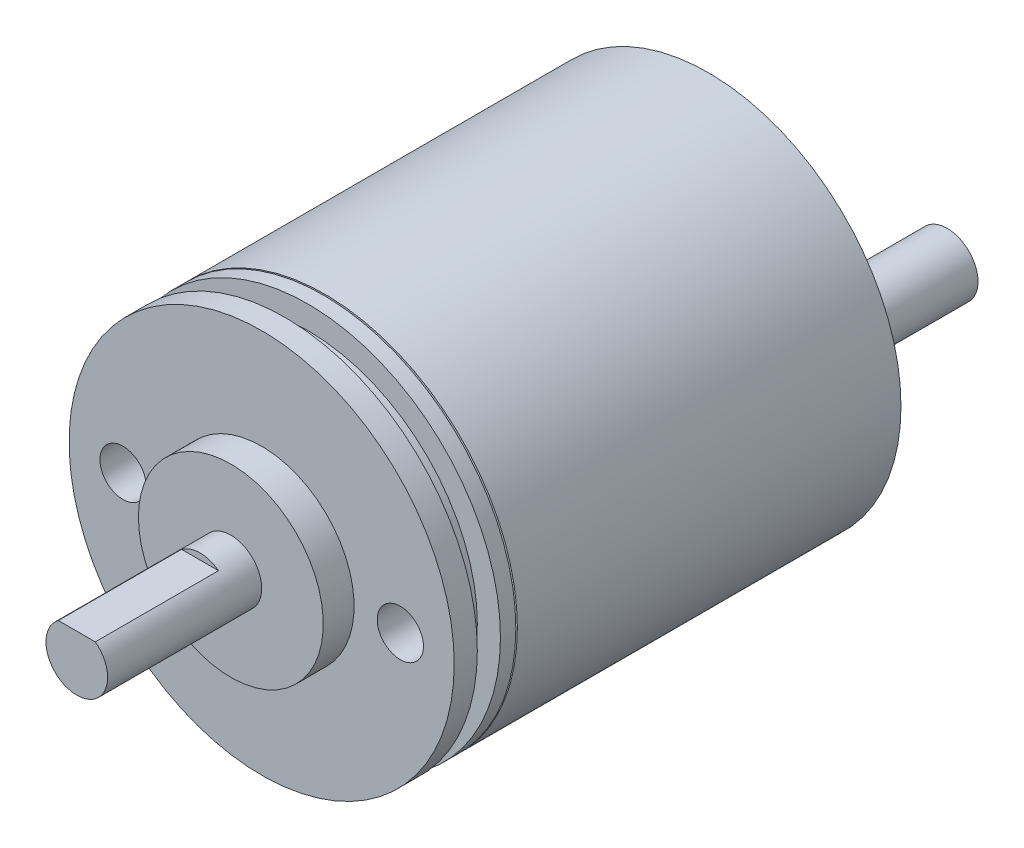
ISO-10303-21;
HEADER;
FILE_DESCRIPTION(('STEP AP214'),'2;1');
FILE_NAME('part.step','',(''),(''),'','','');
FILE_SCHEMA(('AUTOMOTIVE_DESIGN { 1 0 10303 214 1 1 1 1 }'));
ENDSEC;
DATA;
#1=APPLICATION_CONTEXT('core data for automotive mechanical design processes');
#2=APPLICATION_PROTOCOL_DEFINITION('international standard','automotive_design',2000,#1);
#3=PRODUCT_CONTEXT('',#1,'mechanical');
#4=PRODUCT('Part','Part','',(#3));
#5=PRODUCT_RELATED_PRODUCT_CATEGORY('part','',(#4));
#6=PRODUCT_DEFINITION_FORMATION('','',#4);
#7=PRODUCT_DEFINITION_CONTEXT('part definition',#1,'design');
#8=PRODUCT_DEFINITION('design','',#6,#7);
#9=PRODUCT_DEFINITION_SHAPE('','',#8);
#10=(LENGTH_UNIT() NAMED_UNIT(*) SI_UNIT(.MILLI.,.METRE.));
#11=(NAMED_UNIT(*) PLANE_ANGLE_UNIT() SI_UNIT($,.RADIAN.));
#12=(NAMED_UNIT(*) SI_UNIT($,.STERADIAN.) SOLID_ANGLE_UNIT());
#13=UNCERTAINTY_MEASURE_WITH_UNIT(LENGTH_MEASURE(1.E-05),#10,'distance_accuracy_value','');
#14=(GEOMETRIC_REPRESENTATION_CONTEXT(3) GLOBAL_UNCERTAINTY_ASSIGNED_CONTEXT((#13)) GLOBAL_UNIT_ASSIGNED_CONTEXT((#10,
#11,#12)) REPRESENTATION_CONTEXT('',''));
#15=CARTESIAN_POINT('',(0.,0.,0.));
#16=DIRECTION('',(0.,0.,1.));
#17=DIRECTION('',(1.,0.,0.));
#18=AXIS2_PLACEMENT_3D('',#15,#16,#17);
#19=CARTESIAN_POINT('',(-9.,0.,4.));
#20=DIRECTION('',(0.,0.,1.));
#21=DIRECTION('',(1.,0.,0.));
#22=AXIS2_PLACEMENT_3D('',#19,#20,#21);
#23=PLANE('',#22);
#24=CARTESIAN_POINT('',(-9.,0.,4.));
#25=DIRECTION('',(0.,0.,-1.));
#26=DIRECTION('',(-1.,0.,0.));
#27=AXIS2_PLACEMENT_3D('',#24,#25,#26);
#28=CIRCLE('',#27,2.);
#29=CARTESIAN_POINT('',(-10.2,1.6,4.));
#30=VERTEX_POINT('',#29);
#31=CARTESIAN_POINT('',(-7.8,1.6,4.));
#32=VERTEX_POINT('',#31);
#33=EDGE_CURVE('E19',#30,#32,#28,.T.);
#34=ORIENTED_EDGE('',*,*,#33,.F.);
#35=DIRECTION('',(1.,0.,0.));
#36=VECTOR('',#35,1.);
#37=CARTESIAN_POINT('',(-10.2,1.6,4.));
#38=LINE('',#37,#36);
#39=EDGE_CURVE('E33',#30,#32,#38,.T.);
#40=ORIENTED_EDGE('',*,*,#39,.T.);
#41=EDGE_LOOP('',(#34,#40));
#42=FACE_BOUND('',#41,.T.);
#43=ADVANCED_FACE('F16',(#42),#23,.T.);
#44=CARTESIAN_POINT('',(-10.2,1.6,4.));
#45=DIRECTION('',(0.,-1.,0.));
#46=DIRECTION('',(0.,0.,-1.));
#47=AXIS2_PLACEMENT_3D('',#44,#45,#46);
#48=PLANE('',#47);
#49=DIRECTION('',(0.,0.,-1.));
#50=VECTOR('',#49,1.);
#51=CARTESIAN_POINT('',(-7.8,1.6,-16.4289118373157));
#52=LINE('',#51,#50);
#53=CARTESIAN_POINT('',(-7.8,1.6,12.));
#54=VERTEX_POINT('',#53);
#55=EDGE_CURVE('E50',#32,#54,#52,.F.);
#56=ORIENTED_EDGE('',*,*,#55,.F.);
#57=ORIENTED_EDGE('',*,*,#39,.F.);
#58=DIRECTION('',(0.,0.,-1.));
#59=VECTOR('',#58,1.);
#60=CARTESIAN_POINT('',(-10.2,1.6,-16.4289118373157));
#61=LINE('',#60,#59);
#62=CARTESIAN_POINT('',(-10.2,1.6,12.));
#63=VERTEX_POINT('',#62);
#64=EDGE_CURVE('E54',#63,#30,#61,.T.);
#65=ORIENTED_EDGE('',*,*,#64,.F.);
#66=DIRECTION('',(1.,0.,0.));
#67=VECTOR('',#66,1.);
#68=CARTESIAN_POINT('',(-11.,1.6,12.));
#69=LINE('',#68,#67);
#70=EDGE_CURVE('E47',#54,#63,#69,.F.);
#71=ORIENTED_EDGE('',*,*,#70,.F.);
#72=EDGE_LOOP('',(#56,#57,#65,#71));
#73=FACE_BOUND('',#72,.T.);
#74=ADVANCED_FACE('F52',(#73),#48,.F.);
#75=CARTESIAN_POINT('',(-11.,0.,12.));
#76=DIRECTION('',(0.,0.,1.));
#77=DIRECTION('',(1.,0.,0.));
#78=AXIS2_PLACEMENT_3D('',#75,#76,#77);
#79=PLANE('',#78);
#80=CARTESIAN_POINT('',(-9.,0.,12.));
#81=DIRECTION('',(0.,0.,-1.));
#82=DIRECTION('',(-1.,0.,0.));
#83=AXIS2_PLACEMENT_3D('',#80,#81,#82);
#84=CIRCLE('',#83,2.);
#85=EDGE_CURVE('E42',#54,#63,#84,.T.);
#86=ORIENTED_EDGE('',*,*,#85,.F.);
#87=ORIENTED_EDGE('',*,*,#70,.T.);
#88=EDGE_LOOP('',(#86,#87));
#89=FACE_BOUND('',#88,.T.);
#90=ADVANCED_FACE('F46',(#89),#79,.T.);
#91=CARTESIAN_POINT('',(-9.,0.,-16.4289118373157));
#92=DIRECTION('',(0.,0.,-1.));
#93=DIRECTION('',(-1.,0.,0.));
#94=AXIS2_PLACEMENT_3D('',#91,#92,#93);
#95=CYLINDRICAL_SURFACE('',#94,2.);
#96=ORIENTED_EDGE('',*,*,#55,.T.);
#97=ORIENTED_EDGE('',*,*,#85,.T.);
#98=ORIENTED_EDGE('',*,*,#64,.T.);
#99=ORIENTED_EDGE('',*,*,#33,.T.);
#100=EDGE_LOOP('',(#96,#97,#98,#99));
#101=FACE_BOUND('',#100,.T.);
#102=CARTESIAN_POINT('',(-9.,0.,2.));
#103=DIRECTION('',(0.,0.,-1.));
#104=DIRECTION('',(-1.,0.,0.));
#105=AXIS2_PLACEMENT_3D('',#102,#103,#104);
#106=CIRCLE('',#105,2.);
#107=CARTESIAN_POINT('',(-11.,0.,2.));
#108=VERTEX_POINT('',#107);
#109=EDGE_CURVE('E49',#108,#108,#106,.T.);
#110=ORIENTED_EDGE('',*,*,#109,.F.);
#111=EDGE_LOOP('',(#110));
#112=FACE_BOUND('',#111,.T.);
#113=ADVANCED_FACE('F56',(#101,#112),#95,.T.);
#114=CARTESIAN_POINT('',(-18.,0.,-4.));
#115=DIRECTION('',(0.,0.,1.));
#116=DIRECTION('',(1.,0.,0.));
#117=AXIS2_PLACEMENT_3D('',#114,#115,#116);
#118=PLANE('',#117);
#119=CARTESIAN_POINT('',(-18.,0.,-4.));
#120=DIRECTION('',(0.,0.,1.));
#121=DIRECTION('',(1.,0.,0.));
#122=AXIS2_PLACEMENT_3D('',#119,#120,#121);
#123=CIRCLE('',#122,1.5);
#124=CARTESIAN_POINT('',(-16.5,0.,-4.));
#125=VERTEX_POINT('',#124);
#126=EDGE_CURVE('E115',#125,#125,#123,.T.);
#127=ORIENTED_EDGE('',*,*,#126,.T.);
#128=EDGE_LOOP('',(#127));
#129=FACE_BOUND('',#128,.T.);
#130=ADVANCED_FACE('F123',(#129),#118,.T.);
#131=CARTESIAN_POINT('',(0.,0.,-4.));
#132=DIRECTION('',(0.,0.,1.));
#133=DIRECTION('',(1.,0.,0.));
#134=AXIS2_PLACEMENT_3D('',#131,#132,#133);
#135=PLANE('',#134);
#136=CARTESIAN_POINT('',(0.,0.,-4.));
#137=DIRECTION('',(0.,0.,1.));
#138=DIRECTION('',(1.,0.,0.));
#139=AXIS2_PLACEMENT_3D('',#136,#137,#138);
#140=CIRCLE('',#139,1.5);
#141=CARTESIAN_POINT('',(1.5,0.,-4.));
#142=VERTEX_POINT('',#141);
#143=EDGE_CURVE('E112',#142,#142,#140,.T.);
#144=ORIENTED_EDGE('',*,*,#143,.T.);
#145=EDGE_LOOP('',(#144));
#146=FACE_BOUND('',#145,.T.);
#147=ADVANCED_FACE('F130',(#146),#135,.T.);
#148=CARTESIAN_POINT('',(-15.,0.,2.));
#149=DIRECTION('',(0.,0.,1.));
#150=DIRECTION('',(1.,0.,0.));
#151=AXIS2_PLACEMENT_3D('',#148,#149,#150);
#152=PLANE('',#151);
#153=CARTESIAN_POINT('',(-9.,0.,2.));
#154=DIRECTION('',(0.,0.,-1.));
#155=DIRECTION('',(-1.,0.,0.));
#156=AXIS2_PLACEMENT_3D('',#153,#154,#155);
#157=CIRCLE('',#156,6.);
#158=CARTESIAN_POINT('',(-15.,0.,2.));
#159=VERTEX_POINT('',#158);
#160=EDGE_CURVE('E109',#159,#159,#157,.T.);
#161=ORIENTED_EDGE('',*,*,#160,.F.);
#162=EDGE_LOOP('',(#161));
#163=FACE_BOUND('',#162,.T.);
#164=ORIENTED_EDGE('',*,*,#109,.T.);
#165=EDGE_LOOP('',(#164));
#166=FACE_BOUND('',#165,.T.);
#167=ADVANCED_FACE('F121',(#163,#166),#152,.T.);
#168=CARTESIAN_POINT('',(-18.,0.,-4.));
#169=DIRECTION('',(0.,0.,1.));
#170=DIRECTION('',(1.,0.,0.));
#171=AXIS2_PLACEMENT_3D('',#168,#169,#170);
#172=CYLINDRICAL_SURFACE('',#171,1.5);
#173=CARTESIAN_POINT('',(-18.,0.,0.));
#174=DIRECTION('',(0.,0.,1.));
#175=DIRECTION('',(1.,0.,0.));
#176=AXIS2_PLACEMENT_3D('',#173,#174,#175);
#177=CIRCLE('',#176,1.5);
#178=CARTESIAN_POINT('',(-16.5,0.,0.));
#179=VERTEX_POINT('',#178);
#180=EDGE_CURVE('E106',#179,#179,#177,.F.);
#181=ORIENTED_EDGE('',*,*,#180,.F.);
#182=EDGE_LOOP('',(#181));
#183=FACE_BOUND('',#182,.T.);
#184=ORIENTED_EDGE('',*,*,#126,.F.);
#185=EDGE_LOOP('',(#184));
#186=FACE_BOUND('',#185,.T.);
#187=ADVANCED_FACE('F205',(#183,#186),#172,.F.);
#188=CARTESIAN_POINT('',(0.,0.,-4.));
#189=DIRECTION('',(0.,0.,1.));
#190=DIRECTION('',(1.,0.,0.));
#191=AXIS2_PLACEMENT_3D('',#188,#189,#190);
#192=CYLINDRICAL_SURFACE('',#191,1.5);
#193=CARTESIAN_POINT('',(0.,0.,0.));
#194=DIRECTION('',(0.,0.,1.));
#195=DIRECTION('',(1.,0.,0.));
#196=AXIS2_PLACEMENT_3D('',#193,#194,#195);
#197=CIRCLE('',#196,1.5);
#198=CARTESIAN_POINT('',(1.5,0.,0.));
#199=VERTEX_POINT('',#198);
#200=EDGE_CURVE('E103',#199,#199,#197,.F.);
#201=ORIENTED_EDGE('',*,*,#200,.F.);
#202=EDGE_LOOP('',(#201));
#203=FACE_BOUND('',#202,.T.);
#204=ORIENTED_EDGE('',*,*,#143,.F.);
#205=EDGE_LOOP('',(#204));
#206=FACE_BOUND('',#205,.T.);
#207=ADVANCED_FACE('F201',(#203,#206),#192,.F.);
#208=CARTESIAN_POINT('',(-9.,0.,-16.4289118373157));
#209=DIRECTION('',(0.,0.,-1.));
#210=DIRECTION('',(-1.,0.,0.));
#211=AXIS2_PLACEMENT_3D('',#208,#209,#210);
#212=CYLINDRICAL_SURFACE('',#211,6.);
#213=CARTESIAN_POINT('',(-9.,0.,0.));
#214=DIRECTION('',(0.,0.,-1.));
#215=DIRECTION('',(-1.,0.,0.));
#216=AXIS2_PLACEMENT_3D('',#213,#214,#215);
#217=CIRCLE('',#216,6.);
#218=CARTESIAN_POINT('',(-15.,0.,0.));
#219=VERTEX_POINT('',#218);
#220=EDGE_CURVE('E100',#219,#219,#217,.T.);
#221=ORIENTED_EDGE('',*,*,#220,.F.);
#222=EDGE_LOOP('',(#221));
#223=FACE_BOUND('',#222,.T.);
#224=ORIENTED_EDGE('',*,*,#160,.T.);
#225=EDGE_LOOP('',(#224));
#226=FACE_BOUND('',#225,.T.);
#227=ADVANCED_FACE('F197',(#223,#226),#212,.T.);
#228=CARTESIAN_POINT('',(-9.,0.,0.));
#229=DIRECTION('',(0.,0.,1.));
#230=DIRECTION('',(1.,0.,0.));
#231=AXIS2_PLACEMENT_3D('',#228,#229,#230);
#232=PLANE('',#231);
#233=CARTESIAN_POINT('',(-9.,0.,0.));
#234=DIRECTION('',(0.,0.,1.));
#235=DIRECTION('',(1.,0.,0.));
#236=AXIS2_PLACEMENT_3D('',#233,#234,#235);
#237=CIRCLE('',#236,12.5);
#238=CARTESIAN_POINT('',(3.5,0.,0.));
#239=VERTEX_POINT('',#238);
#240=EDGE_CURVE('E97',#239,#239,#237,.F.);
#241=ORIENTED_EDGE('',*,*,#240,.F.);
#242=EDGE_LOOP('',(#241));
#243=FACE_BOUND('',#242,.T.);
#244=ORIENTED_EDGE('',*,*,#220,.T.);
#245=EDGE_LOOP('',(#244));
#246=FACE_BOUND('',#245,.T.);
#247=ORIENTED_EDGE('',*,*,#200,.T.);
#248=EDGE_LOOP('',(#247));
#249=FACE_BOUND('',#248,.T.);
#250=ORIENTED_EDGE('',*,*,#180,.T.);
#251=EDGE_LOOP('',(#250));
#252=FACE_BOUND('',#251,.T.);
#253=ADVANCED_FACE('F193',(#243,#246,#249,#252),#232,.T.);
#254=CARTESIAN_POINT('',(-9.,0.,-29.));
#255=DIRECTION('',(0.,0.,1.));
#256=DIRECTION('',(1.,0.,0.));
#257=AXIS2_PLACEMENT_3D('',#254,#255,#256);
#258=CYLINDRICAL_SURFACE('',#257,12.5);
#259=ORIENTED_EDGE('',*,*,#240,.T.);
#260=EDGE_LOOP('',(#259));
#261=FACE_BOUND('',#260,.T.);
#262=CARTESIAN_POINT('',(-9.,0.,-1.5));
#263=DIRECTION('',(0.,0.,1.));
#264=DIRECTION('',(1.,0.,0.));
#265=AXIS2_PLACEMENT_3D('',#262,#263,#264);
#266=CIRCLE('',#265,12.5);
#267=CARTESIAN_POINT('',(3.5,0.,-1.5));
#268=VERTEX_POINT('',#267);
#269=EDGE_CURVE('E94',#268,#268,#266,.T.);
#270=ORIENTED_EDGE('',*,*,#269,.T.);
#271=EDGE_LOOP('',(#270));
#272=FACE_BOUND('',#271,.T.);
#273=ADVANCED_FACE('F189',(#261,#272),#258,.T.);
#274=CARTESIAN_POINT('',(-9.,0.,-1.5));
#275=DIRECTION('',(0.,0.,1.));
#276=DIRECTION('',(1.,0.,0.));
#277=AXIS2_PLACEMENT_3D('',#274,#275,#276);
#278=PLANE('',#277);
#279=ORIENTED_EDGE('',*,*,#269,.F.);
#280=EDGE_LOOP('',(#279));
#281=FACE_BOUND('',#280,.T.);
#282=CARTESIAN_POINT('',(-9.,0.,-1.5));
#283=DIRECTION('',(0.,0.,1.));
#284=DIRECTION('',(1.,0.,0.));
#285=AXIS2_PLACEMENT_3D('',#282,#283,#284);
#286=CIRCLE('',#285,11.);
#287=CARTESIAN_POINT('',(2.,0.,-1.5));
#288=VERTEX_POINT('',#287);
#289=EDGE_CURVE('E91',#288,#288,#286,.F.);
#290=ORIENTED_EDGE('',*,*,#289,.F.);
#291=EDGE_LOOP('',(#290));
#292=FACE_BOUND('',#291,.T.);
#293=ADVANCED_FACE('F185',(#281,#292),#278,.F.);
#294=CARTESIAN_POINT('',(-9.,0.,-3.));
#295=DIRECTION('',(0.,0.,1.));
#296=DIRECTION('',(1.,0.,0.));
#297=AXIS2_PLACEMENT_3D('',#294,#295,#296);
#298=CYLINDRICAL_SURFACE('',#297,11.);
#299=CARTESIAN_POINT('',(-9.,0.,-3.));
#300=DIRECTION('',(0.,0.,1.));
#301=DIRECTION('',(1.,0.,0.));
#302=AXIS2_PLACEMENT_3D('',#299,#300,#301);
#303=CIRCLE('',#302,11.);
#304=CARTESIAN_POINT('',(2.,0.,-3.));
#305=VERTEX_POINT('',#304);
#306=EDGE_CURVE('E88',#305,#305,#303,.F.);
#307=ORIENTED_EDGE('',*,*,#306,.F.);
#308=EDGE_LOOP('',(#307));
#309=FACE_BOUND('',#308,.T.);
#310=ORIENTED_EDGE('',*,*,#289,.T.);
#311=EDGE_LOOP('',(#310));
#312=FACE_BOUND('',#311,.T.);
#313=ADVANCED_FACE('F181',(#309,#312),#298,.T.);
#314=CARTESIAN_POINT('',(-9.,-6.,-44.5));
#315=DIRECTION('',(0.,0.,-1.));
#316=DIRECTION('',(-1.,0.,0.));
#317=AXIS2_PLACEMENT_3D('',#314,#315,#316);
#318=PLANE('',#317);
#319=CARTESIAN_POINT('',(-9.,-6.,-44.5));
#320=DIRECTION('',(0.,0.,1.));
#321=DIRECTION('',(1.,0.,0.));
#322=AXIS2_PLACEMENT_3D('',#319,#320,#321);
#323=CIRCLE('',#322,2.);
#324=CARTESIAN_POINT('',(-7.,-6.,-44.5));
#325=VERTEX_POINT('',#324);
#326=EDGE_CURVE('E85',#325,#325,#323,.T.);
#327=ORIENTED_EDGE('',*,*,#326,.F.);
#328=EDGE_LOOP('',(#327));
#329=FACE_BOUND('',#328,.T.);
#330=ADVANCED_FACE('F177',(#329),#318,.T.);
#331=CARTESIAN_POINT('',(-9.,0.,-3.));
#332=DIRECTION('',(0.,0.,1.));
#333=DIRECTION('',(1.,0.,0.));
#334=AXIS2_PLACEMENT_3D('',#331,#332,#333);
#335=PLANE('',#334);
#336=CARTESIAN_POINT('',(-9.,0.,-3.));
#337=DIRECTION('',(0.,0.,1.));
#338=DIRECTION('',(1.,0.,0.));
#339=AXIS2_PLACEMENT_3D('',#336,#337,#338);
#340=CIRCLE('',#339,12.5);
#341=CARTESIAN_POINT('',(3.5,0.,-3.));
#342=VERTEX_POINT('',#341);
#343=EDGE_CURVE('E82',#342,#342,#340,.F.);
#344=ORIENTED_EDGE('',*,*,#343,.F.);
#345=EDGE_LOOP('',(#344));
#346=FACE_BOUND('',#345,.T.);
#347=ORIENTED_EDGE('',*,*,#306,.T.);
#348=EDGE_LOOP('',(#347));
#349=FACE_BOUND('',#348,.T.);
#350=ADVANCED_FACE('F173',(#346,#349),#335,.T.);
#351=CARTESIAN_POINT('',(-9.,-6.,-44.5));
#352=DIRECTION('',(0.,0.,1.));
#353=DIRECTION('',(1.,0.,0.));
#354=AXIS2_PLACEMENT_3D('',#351,#352,#353);
#355=CYLINDRICAL_SURFACE('',#354,2.);
#356=CARTESIAN_POINT('',(-9.,-6.,-34.5));
#357=DIRECTION('',(0.,0.,1.));
#358=DIRECTION('',(1.,0.,0.));
#359=AXIS2_PLACEMENT_3D('',#356,#357,#358);
#360=CIRCLE('',#359,2.);
#361=CARTESIAN_POINT('',(-7.,-6.,-34.5));
#362=VERTEX_POINT('',#361);
#363=EDGE_CURVE('E79',#362,#362,#360,.T.);
#364=ORIENTED_EDGE('',*,*,#363,.F.);
#365=EDGE_LOOP('',(#364));
#366=FACE_BOUND('',#365,.T.);
#367=ORIENTED_EDGE('',*,*,#326,.T.);
#368=EDGE_LOOP('',(#367));
#369=FACE_BOUND('',#368,.T.);
#370=ADVANCED_FACE('F169',(#366,#369),#355,.T.);
#371=CARTESIAN_POINT('',(-9.,0.,-29.));
#372=DIRECTION('',(0.,0.,1.));
#373=DIRECTION('',(1.,0.,0.));
#374=AXIS2_PLACEMENT_3D('',#371,#372,#373);
#375=CYLINDRICAL_SURFACE('',#374,12.5);
#376=ORIENTED_EDGE('',*,*,#343,.T.);
#377=EDGE_LOOP('',(#376));
#378=FACE_BOUND('',#377,.T.);
#379=CARTESIAN_POINT('',(-9.,0.,-4.));
#380=DIRECTION('',(0.,0.,1.));
#381=DIRECTION('',(1.,0.,0.));
#382=AXIS2_PLACEMENT_3D('',#379,#380,#381);
#383=CIRCLE('',#382,12.5);
#384=CARTESIAN_POINT('',(3.5,0.,-4.));
#385=VERTEX_POINT('',#384);
#386=EDGE_CURVE('E76',#385,#385,#383,.T.);
#387=ORIENTED_EDGE('',*,*,#386,.T.);
#388=EDGE_LOOP('',(#387));
#389=FACE_BOUND('',#388,.T.);
#390=ADVANCED_FACE('F165',(#378,#389),#375,.T.);
#391=CARTESIAN_POINT('',(-9.,-6.,-34.5));
#392=DIRECTION('',(0.,0.,-1.));
#393=DIRECTION('',(-1.,0.,0.));
#394=AXIS2_PLACEMENT_3D('',#391,#392,#393);
#395=PLANE('',#394);
#396=ORIENTED_EDGE('',*,*,#363,.T.);
#397=EDGE_LOOP('',(#396));
#398=FACE_BOUND('',#397,.T.);
#399=CARTESIAN_POINT('',(-9.,-6.,-34.5));
#400=DIRECTION('',(0.,0.,1.));
#401=DIRECTION('',(1.,0.,0.));
#402=AXIS2_PLACEMENT_3D('',#399,#400,#401);
#403=CIRCLE('',#402,3.25);
#404=CARTESIAN_POINT('',(-5.75,-6.,-34.5));
#405=VERTEX_POINT('',#404);
#406=EDGE_CURVE('E73',#405,#405,#403,.T.);
#407=ORIENTED_EDGE('',*,*,#406,.F.);
#408=EDGE_LOOP('',(#407));
#409=FACE_BOUND('',#408,.T.);
#410=ADVANCED_FACE('F161',(#398,#409),#395,.T.);
#411=CARTESIAN_POINT('',(-9.,0.,-4.));
#412=DIRECTION('',(0.,0.,1.));
#413=DIRECTION('',(1.,0.,0.));
#414=AXIS2_PLACEMENT_3D('',#411,#412,#413);
#415=PLANE('',#414);
#416=ORIENTED_EDGE('',*,*,#386,.F.);
#417=EDGE_LOOP('',(#416));
#418=FACE_BOUND('',#417,.T.);
#419=CARTESIAN_POINT('',(-9.,0.,-4.));
#420=DIRECTION('',(0.,0.,1.));
#421=DIRECTION('',(1.,0.,0.));
#422=AXIS2_PLACEMENT_3D('',#419,#420,#421);
#423=CIRCLE('',#422,11.5);
#424=CARTESIAN_POINT('',(2.5,0.,-4.));
#425=VERTEX_POINT('',#424);
#426=EDGE_CURVE('E70',#425,#425,#423,.F.);
#427=ORIENTED_EDGE('',*,*,#426,.F.);
#428=EDGE_LOOP('',(#427));
#429=FACE_BOUND('',#428,.T.);
#430=ADVANCED_FACE('F157',(#418,#429),#415,.F.);
#431=CARTESIAN_POINT('',(-9.,-6.,-34.5));
#432=DIRECTION('',(0.,0.,1.));
#433=DIRECTION('',(1.,0.,0.));
#434=AXIS2_PLACEMENT_3D('',#431,#432,#433);
#435=CYLINDRICAL_SURFACE('',#434,3.25);
#436=ORIENTED_EDGE('',*,*,#406,.T.);
#437=EDGE_LOOP('',(#436));
#438=FACE_BOUND('',#437,.T.);
#439=CARTESIAN_POINT('',(-9.,-6.,-29.));
#440=DIRECTION('',(0.,0.,1.));
#441=DIRECTION('',(1.,0.,0.));
#442=AXIS2_PLACEMENT_3D('',#439,#440,#441);
#443=CIRCLE('',#442,3.25);
#444=CARTESIAN_POINT('',(-5.75,-6.,-29.));
#445=VERTEX_POINT('',#444);
#446=EDGE_CURVE('E67',#445,#445,#443,.F.);
#447=ORIENTED_EDGE('',*,*,#446,.T.);
#448=EDGE_LOOP('',(#447));
#449=FACE_BOUND('',#448,.T.);
#450=ADVANCED_FACE('F153',(#438,#449),#435,.T.);
#451=CARTESIAN_POINT('',(-9.,0.,-4.1));
#452=DIRECTION('',(0.,0.,1.));
#453=DIRECTION('',(1.,0.,0.));
#454=AXIS2_PLACEMENT_3D('',#451,#452,#453);
#455=CYLINDRICAL_SURFACE('',#454,11.5);
#456=CARTESIAN_POINT('',(-9.,0.,-4.1));
#457=DIRECTION('',(0.,0.,1.));
#458=DIRECTION('',(1.,0.,0.));
#459=AXIS2_PLACEMENT_3D('',#456,#457,#458);
#460=CIRCLE('',#459,11.5);
#461=CARTESIAN_POINT('',(2.5,0.,-4.1));
#462=VERTEX_POINT('',#461);
#463=EDGE_CURVE('E64',#462,#462,#460,.F.);
#464=ORIENTED_EDGE('',*,*,#463,.F.);
#465=EDGE_LOOP('',(#464));
#466=FACE_BOUND('',#465,.T.);
#467=ORIENTED_EDGE('',*,*,#426,.T.);
#468=EDGE_LOOP('',(#467));
#469=FACE_BOUND('',#468,.T.);
#470=ADVANCED_FACE('F149',(#466,#469),#455,.T.);
#471=CARTESIAN_POINT('',(-9.,0.,-29.));
#472=DIRECTION('',(0.,0.,1.));
#473=DIRECTION('',(1.,0.,0.));
#474=AXIS2_PLACEMENT_3D('',#471,#472,#473);
#475=PLANE('',#474);
#476=ORIENTED_EDGE('',*,*,#446,.F.);
#477=EDGE_LOOP('',(#476));
#478=FACE_BOUND('',#477,.T.);
#479=CARTESIAN_POINT('',(-9.,0.,-29.));
#480=DIRECTION('',(0.,0.,1.));
#481=DIRECTION('',(1.,0.,0.));
#482=AXIS2_PLACEMENT_3D('',#479,#480,#481);
#483=CIRCLE('',#482,12.5);
#484=CARTESIAN_POINT('',(3.5,0.,-29.));
#485=VERTEX_POINT('',#484);
#486=EDGE_CURVE('E25',#485,#485,#483,.T.);
#487=ORIENTED_EDGE('',*,*,#486,.F.);
#488=EDGE_LOOP('',(#487));
#489=FACE_BOUND('',#488,.T.);
#490=ADVANCED_FACE('F142',(#478,#489),#475,.F.);
#491=CARTESIAN_POINT('',(-9.,0.,-4.1));
#492=DIRECTION('',(0.,0.,1.));
#493=DIRECTION('',(1.,0.,0.));
#494=AXIS2_PLACEMENT_3D('',#491,#492,#493);
#495=PLANE('',#494);
#496=CARTESIAN_POINT('',(-9.,0.,-4.1));
#497=DIRECTION('',(0.,0.,1.));
#498=DIRECTION('',(1.,0.,0.));
#499=AXIS2_PLACEMENT_3D('',#496,#497,#498);
#500=CIRCLE('',#499,12.5);
#501=CARTESIAN_POINT('',(3.5,0.,-4.1));
#502=VERTEX_POINT('',#501);
#503=EDGE_CURVE('E11',#502,#502,#500,.F.);
#504=ORIENTED_EDGE('',*,*,#503,.F.);
#505=EDGE_LOOP('',(#504));
#506=FACE_BOUND('',#505,.T.);
#507=ORIENTED_EDGE('',*,*,#463,.T.);
#508=EDGE_LOOP('',(#507));
#509=FACE_BOUND('',#508,.T.);
#510=ADVANCED_FACE('F136',(#506,#509),#495,.T.);
#511=CARTESIAN_POINT('',(-9.,0.,-29.));
#512=DIRECTION('',(0.,0.,1.));
#513=DIRECTION('',(1.,0.,0.));
#514=AXIS2_PLACEMENT_3D('',#511,#512,#513);
#515=CYLINDRICAL_SURFACE('',#514,12.5);
#516=ORIENTED_EDGE('',*,*,#486,.T.);
#517=EDGE_LOOP('',(#516));
#518=FACE_BOUND('',#517,.T.);
#519=ORIENTED_EDGE('',*,*,#503,.T.);
#520=EDGE_LOOP('',(#519));
#521=FACE_BOUND('',#520,.T.);
#522=ADVANCED_FACE('F134',(#518,#521),#515,.T.);
#523=CLOSED_SHELL('',(#43,#74,#90,#113,#130,#147,#167,#187,#207,#227,#253,#273,#293,#313,#330,
#350,#370,#390,#410,#430,#450,#470,#490,#510,#522));
#524=MANIFOLD_SOLID_BREP('B1',#523);
#525=ADVANCED_BREP_SHAPE_REPRESENTATION('',(#18,#524),#14);
#526=SHAPE_DEFINITION_REPRESENTATION(#9,#525);
ENDSEC;
END-ISO-10303-21;
